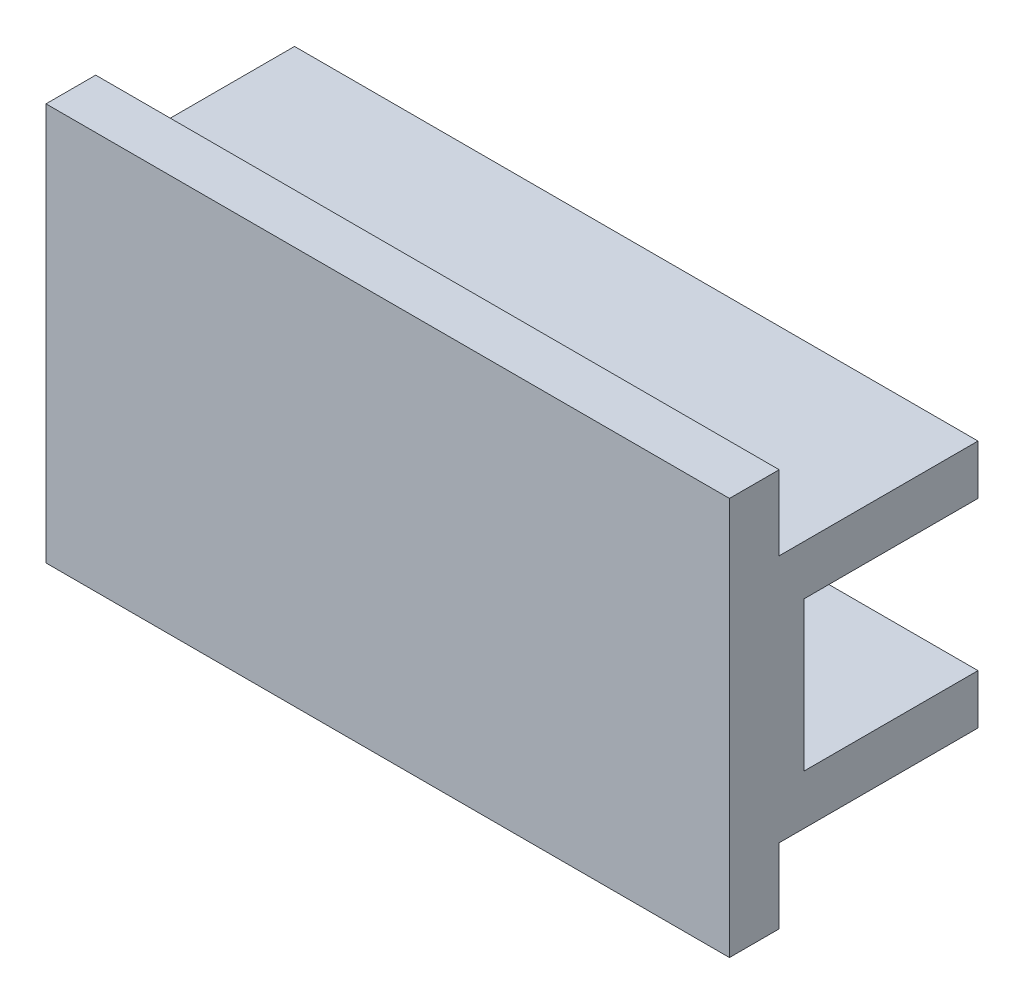
ISO-10303-21;
HEADER;
FILE_DESCRIPTION(('STEP AP214'),'2;1');
FILE_NAME('part.step','',(''),(''),'','','');
FILE_SCHEMA(('AUTOMOTIVE_DESIGN { 1 0 10303 214 1 1 1 1 }'));
ENDSEC;
DATA;
#1=APPLICATION_CONTEXT('core data for automotive mechanical design processes');
#2=APPLICATION_PROTOCOL_DEFINITION('international standard','automotive_design',2000,#1);
#3=PRODUCT_CONTEXT('',#1,'mechanical');
#4=PRODUCT('Part','Part','',(#3));
#5=PRODUCT_RELATED_PRODUCT_CATEGORY('part','',(#4));
#6=PRODUCT_DEFINITION_FORMATION('','',#4);
#7=PRODUCT_DEFINITION_CONTEXT('part definition',#1,'design');
#8=PRODUCT_DEFINITION('design','',#6,#7);
#9=PRODUCT_DEFINITION_SHAPE('','',#8);
#10=(LENGTH_UNIT() NAMED_UNIT(*) SI_UNIT(.MILLI.,.METRE.));
#11=(NAMED_UNIT(*) PLANE_ANGLE_UNIT() SI_UNIT($,.RADIAN.));
#12=(NAMED_UNIT(*) SI_UNIT($,.STERADIAN.) SOLID_ANGLE_UNIT());
#13=UNCERTAINTY_MEASURE_WITH_UNIT(LENGTH_MEASURE(1.E-05),#10,'distance_accuracy_value','');
#14=(GEOMETRIC_REPRESENTATION_CONTEXT(3) GLOBAL_UNCERTAINTY_ASSIGNED_CONTEXT((#13)) GLOBAL_UNIT_ASSIGNED_CONTEXT((#10,
#11,#12)) REPRESENTATION_CONTEXT('',''));
#15=CARTESIAN_POINT('',(0.,0.,0.));
#16=DIRECTION('',(0.,0.,1.));
#17=DIRECTION('',(1.,0.,0.));
#18=AXIS2_PLACEMENT_3D('',#15,#16,#17);
#19=CARTESIAN_POINT('',(13.75,8.,5.));
#20=DIRECTION('',(0.,0.,-1.));
#21=DIRECTION('',(-1.,0.,0.));
#22=AXIS2_PLACEMENT_3D('',#19,#20,#21);
#23=PLANE('',#22);
#24=DIRECTION('',(0.,-1.,0.));
#25=VECTOR('',#24,1.);
#26=CARTESIAN_POINT('',(-13.75,8.,5.));
#27=LINE('',#26,#25);
#28=CARTESIAN_POINT('',(-13.75,8.,5.));
#29=VERTEX_POINT('',#28);
#30=CARTESIAN_POINT('',(-13.75,-8.,5.));
#31=VERTEX_POINT('',#30);
#32=EDGE_CURVE('E152',#29,#31,#27,.T.);
#33=ORIENTED_EDGE('',*,*,#32,.T.);
#34=DIRECTION('',(-1.,0.,0.));
#35=VECTOR('',#34,1.);
#36=CARTESIAN_POINT('',(13.75,-8.,5.));
#37=LINE('',#36,#35);
#38=CARTESIAN_POINT('',(13.75,-8.,5.));
#39=VERTEX_POINT('',#38);
#40=EDGE_CURVE('E11',#39,#31,#37,.T.);
#41=ORIENTED_EDGE('',*,*,#40,.F.);
#42=DIRECTION('',(0.,-1.,0.));
#43=VECTOR('',#42,1.);
#44=CARTESIAN_POINT('',(13.75,8.,5.));
#45=LINE('',#44,#43);
#46=CARTESIAN_POINT('',(13.75,8.,5.));
#47=VERTEX_POINT('',#46);
#48=EDGE_CURVE('E174',#47,#39,#45,.T.);
#49=ORIENTED_EDGE('',*,*,#48,.F.);
#50=DIRECTION('',(-1.,0.,0.));
#51=VECTOR('',#50,1.);
#52=CARTESIAN_POINT('',(13.75,8.,5.));
#53=LINE('',#52,#51);
#54=EDGE_CURVE('E148',#47,#29,#53,.T.);
#55=ORIENTED_EDGE('',*,*,#54,.T.);
#56=EDGE_LOOP('',(#33,#41,#49,#55));
#57=FACE_BOUND('',#56,.T.);
#58=ADVANCED_FACE('F34',(#57),#23,.F.);
#59=CARTESIAN_POINT('',(13.75,-8.,5.));
#60=DIRECTION('',(0.,1.,0.));
#61=DIRECTION('',(0.,0.,1.));
#62=AXIS2_PLACEMENT_3D('',#59,#60,#61);
#63=PLANE('',#62);
#64=DIRECTION('',(0.,0.,-1.));
#65=VECTOR('',#64,1.);
#66=CARTESIAN_POINT('',(-13.75,-8.,5.));
#67=LINE('',#66,#65);
#68=CARTESIAN_POINT('',(-13.75,-8.,3.));
#69=VERTEX_POINT('',#68);
#70=EDGE_CURVE('E155',#31,#69,#67,.T.);
#71=ORIENTED_EDGE('',*,*,#70,.T.);
#72=DIRECTION('',(-1.,0.,0.));
#73=VECTOR('',#72,1.);
#74=CARTESIAN_POINT('',(13.75,-8.,3.));
#75=LINE('',#74,#73);
#76=CARTESIAN_POINT('',(13.75,-8.,3.));
#77=VERTEX_POINT('',#76);
#78=EDGE_CURVE('E42',#77,#69,#75,.T.);
#79=ORIENTED_EDGE('',*,*,#78,.F.);
#80=DIRECTION('',(0.,0.,-1.));
#81=VECTOR('',#80,1.);
#82=CARTESIAN_POINT('',(13.75,-8.,5.));
#83=LINE('',#82,#81);
#84=EDGE_CURVE('E100',#39,#77,#83,.T.);
#85=ORIENTED_EDGE('',*,*,#84,.F.);
#86=ORIENTED_EDGE('',*,*,#40,.T.);
#87=EDGE_LOOP('',(#71,#79,#85,#86));
#88=FACE_BOUND('',#87,.T.);
#89=ADVANCED_FACE('F253',(#88),#63,.F.);
#90=CARTESIAN_POINT('',(13.75,-5.,3.));
#91=DIRECTION('',(0.,0.,1.));
#92=DIRECTION('',(0.,-1.,0.));
#93=AXIS2_PLACEMENT_3D('',#90,#91,#92);
#94=PLANE('',#93);
#95=DIRECTION('',(0.,1.,0.));
#96=VECTOR('',#95,1.);
#97=CARTESIAN_POINT('',(-13.75,-5.,3.));
#98=LINE('',#97,#96);
#99=CARTESIAN_POINT('',(-13.75,-5.,3.));
#100=VERTEX_POINT('',#99);
#101=EDGE_CURVE('E158',#69,#100,#98,.T.);
#102=ORIENTED_EDGE('',*,*,#101,.T.);
#103=DIRECTION('',(-1.,0.,0.));
#104=VECTOR('',#103,1.);
#105=CARTESIAN_POINT('',(13.75,-5.,3.));
#106=LINE('',#105,#104);
#107=CARTESIAN_POINT('',(13.75,-5.,3.));
#108=VERTEX_POINT('',#107);
#109=EDGE_CURVE('E193',#108,#100,#106,.T.);
#110=ORIENTED_EDGE('',*,*,#109,.F.);
#111=DIRECTION('',(0.,1.,0.));
#112=VECTOR('',#111,1.);
#113=CARTESIAN_POINT('',(13.75,-5.,3.));
#114=LINE('',#113,#112);
#115=EDGE_CURVE('E201',#77,#108,#114,.T.);
#116=ORIENTED_EDGE('',*,*,#115,.F.);
#117=ORIENTED_EDGE('',*,*,#78,.T.);
#118=EDGE_LOOP('',(#102,#110,#116,#117));
#119=FACE_BOUND('',#118,.T.);
#120=ADVANCED_FACE('F199',(#119),#94,.F.);
#121=CARTESIAN_POINT('',(13.75,-5.,-5.));
#122=DIRECTION('',(0.,1.,0.));
#123=DIRECTION('',(0.,0.,1.));
#124=AXIS2_PLACEMENT_3D('',#121,#122,#123);
#125=PLANE('',#124);
#126=DIRECTION('',(0.,0.,-1.));
#127=VECTOR('',#126,1.);
#128=CARTESIAN_POINT('',(-13.75,-5.,-5.));
#129=LINE('',#128,#127);
#130=CARTESIAN_POINT('',(-13.75,-5.,-5.));
#131=VERTEX_POINT('',#130);
#132=EDGE_CURVE('E160',#100,#131,#129,.T.);
#133=ORIENTED_EDGE('',*,*,#132,.T.);
#134=DIRECTION('',(-1.,0.,0.));
#135=VECTOR('',#134,1.);
#136=CARTESIAN_POINT('',(13.75,-5.,-5.));
#137=LINE('',#136,#135);
#138=CARTESIAN_POINT('',(13.75,-5.,-5.));
#139=VERTEX_POINT('',#138);
#140=EDGE_CURVE('E190',#139,#131,#137,.T.);
#141=ORIENTED_EDGE('',*,*,#140,.F.);
#142=DIRECTION('',(0.,0.,-1.));
#143=VECTOR('',#142,1.);
#144=CARTESIAN_POINT('',(13.75,-5.,-5.));
#145=LINE('',#144,#143);
#146=EDGE_CURVE('E220',#108,#139,#145,.T.);
#147=ORIENTED_EDGE('',*,*,#146,.F.);
#148=ORIENTED_EDGE('',*,*,#109,.T.);
#149=EDGE_LOOP('',(#133,#141,#147,#148));
#150=FACE_BOUND('',#149,.T.);
#151=ADVANCED_FACE('F211',(#150),#125,.F.);
#152=CARTESIAN_POINT('',(13.75,-3.,-5.));
#153=DIRECTION('',(0.,0.,1.));
#154=DIRECTION('',(1.,0.,0.));
#155=AXIS2_PLACEMENT_3D('',#152,#153,#154);
#156=PLANE('',#155);
#157=DIRECTION('',(0.,1.,0.));
#158=VECTOR('',#157,1.);
#159=CARTESIAN_POINT('',(-13.75,-3.,-5.));
#160=LINE('',#159,#158);
#161=CARTESIAN_POINT('',(-13.75,-3.,-5.));
#162=VERTEX_POINT('',#161);
#163=EDGE_CURVE('E162',#131,#162,#160,.T.);
#164=ORIENTED_EDGE('',*,*,#163,.T.);
#165=DIRECTION('',(-1.,0.,0.));
#166=VECTOR('',#165,1.);
#167=CARTESIAN_POINT('',(13.75,-3.,-5.));
#168=LINE('',#167,#166);
#169=CARTESIAN_POINT('',(13.75,-3.,-5.));
#170=VERTEX_POINT('',#169);
#171=EDGE_CURVE('E187',#170,#162,#168,.T.);
#172=ORIENTED_EDGE('',*,*,#171,.F.);
#173=DIRECTION('',(0.,1.,0.));
#174=VECTOR('',#173,1.);
#175=CARTESIAN_POINT('',(13.75,-3.,-5.));
#176=LINE('',#175,#174);
#177=EDGE_CURVE('E217',#139,#170,#176,.T.);
#178=ORIENTED_EDGE('',*,*,#177,.F.);
#179=ORIENTED_EDGE('',*,*,#140,.T.);
#180=EDGE_LOOP('',(#164,#172,#178,#179));
#181=FACE_BOUND('',#180,.T.);
#182=ADVANCED_FACE('F215',(#181),#156,.F.);
#183=CARTESIAN_POINT('',(13.75,-3.,2.));
#184=DIRECTION('',(0.,-1.,0.));
#185=DIRECTION('',(0.,0.,-1.));
#186=AXIS2_PLACEMENT_3D('',#183,#184,#185);
#187=PLANE('',#186);
#188=DIRECTION('',(0.,0.,1.));
#189=VECTOR('',#188,1.);
#190=CARTESIAN_POINT('',(-13.75,-3.,2.));
#191=LINE('',#190,#189);
#192=CARTESIAN_POINT('',(-13.75,-3.,3.));
#193=VERTEX_POINT('',#192);
#194=EDGE_CURVE('E164',#162,#193,#191,.T.);
#195=ORIENTED_EDGE('',*,*,#194,.T.);
#196=DIRECTION('',(-1.,0.,0.));
#197=VECTOR('',#196,1.);
#198=CARTESIAN_POINT('',(7.75,-3.,3.));
#199=LINE('',#198,#197);
#200=CARTESIAN_POINT('',(7.75,-3.,3.));
#201=VERTEX_POINT('',#200);
#202=EDGE_CURVE('E365',#201,#193,#199,.T.);
#203=ORIENTED_EDGE('',*,*,#202,.F.);
#204=DIRECTION('',(0.,0.,1.));
#205=VECTOR('',#204,1.);
#206=CARTESIAN_POINT('',(7.75,-3.,3.));
#207=LINE('',#206,#205);
#208=CARTESIAN_POINT('',(7.75,-3.,2.));
#209=VERTEX_POINT('',#208);
#210=EDGE_CURVE('E366',#209,#201,#207,.T.);
#211=ORIENTED_EDGE('',*,*,#210,.F.);
#212=DIRECTION('',(-1.,0.,0.));
#213=VECTOR('',#212,1.);
#214=CARTESIAN_POINT('',(13.75,-3.,2.));
#215=LINE('',#214,#213);
#216=CARTESIAN_POINT('',(13.75,-3.,2.));
#217=VERTEX_POINT('',#216);
#218=EDGE_CURVE('E184',#217,#209,#215,.T.);
#219=ORIENTED_EDGE('',*,*,#218,.F.);
#220=DIRECTION('',(0.,0.,1.));
#221=VECTOR('',#220,1.);
#222=CARTESIAN_POINT('',(13.75,-3.,2.));
#223=LINE('',#222,#221);
#224=EDGE_CURVE('E219',#170,#217,#223,.T.);
#225=ORIENTED_EDGE('',*,*,#224,.F.);
#226=ORIENTED_EDGE('',*,*,#171,.T.);
#227=EDGE_LOOP('',(#195,#203,#211,#219,#225,#226));
#228=FACE_BOUND('',#227,.T.);
#229=ADVANCED_FACE('F266',(#228),#187,.F.);
#230=CARTESIAN_POINT('',(13.75,3.,2.));
#231=DIRECTION('',(0.,0.,1.));
#232=DIRECTION('',(0.,-1.,0.));
#233=AXIS2_PLACEMENT_3D('',#230,#231,#232);
#234=PLANE('',#233);
#235=ORIENTED_EDGE('',*,*,#218,.T.);
#236=CARTESIAN_POINT('',(7.75,0.,2.));
#237=DIRECTION('',(0.,0.,-1.));
#238=DIRECTION('',(0.,1.,0.));
#239=AXIS2_PLACEMENT_3D('',#236,#237,#238);
#240=CIRCLE('',#239,3.);
#241=CARTESIAN_POINT('',(7.75,3.,2.));
#242=VERTEX_POINT('',#241);
#243=EDGE_CURVE('E358',#242,#209,#240,.T.);
#244=ORIENTED_EDGE('',*,*,#243,.F.);
#245=DIRECTION('',(-1.,0.,0.));
#246=VECTOR('',#245,1.);
#247=CARTESIAN_POINT('',(13.75,3.,2.));
#248=LINE('',#247,#246);
#249=CARTESIAN_POINT('',(13.75,3.,2.));
#250=VERTEX_POINT('',#249);
#251=EDGE_CURVE('E181',#250,#242,#248,.T.);
#252=ORIENTED_EDGE('',*,*,#251,.F.);
#253=DIRECTION('',(0.,1.,0.));
#254=VECTOR('',#253,1.);
#255=CARTESIAN_POINT('',(13.75,3.,2.));
#256=LINE('',#255,#254);
#257=EDGE_CURVE('E222',#217,#250,#256,.T.);
#258=ORIENTED_EDGE('',*,*,#257,.F.);
#259=EDGE_LOOP('',(#235,#244,#252,#258));
#260=FACE_BOUND('',#259,.T.);
#261=ADVANCED_FACE('F269',(#260),#234,.F.);
#262=CARTESIAN_POINT('',(13.75,3.,-5.));
#263=DIRECTION('',(0.,1.,0.));
#264=DIRECTION('',(0.,0.,1.));
#265=AXIS2_PLACEMENT_3D('',#262,#263,#264);
#266=PLANE('',#265);
#267=DIRECTION('',(0.,0.,-1.));
#268=VECTOR('',#267,1.);
#269=CARTESIAN_POINT('',(-13.75,3.,-5.));
#270=LINE('',#269,#268);
#271=CARTESIAN_POINT('',(-13.75,3.,3.));
#272=VERTEX_POINT('',#271);
#273=CARTESIAN_POINT('',(-13.75,3.,-5.));
#274=VERTEX_POINT('',#273);
#275=EDGE_CURVE('E167',#272,#274,#270,.T.);
#276=ORIENTED_EDGE('',*,*,#275,.T.);
#277=DIRECTION('',(-1.,0.,0.));
#278=VECTOR('',#277,1.);
#279=CARTESIAN_POINT('',(13.75,3.,-5.));
#280=LINE('',#279,#278);
#281=CARTESIAN_POINT('',(13.75,3.,-5.));
#282=VERTEX_POINT('',#281);
#283=EDGE_CURVE('E178',#282,#274,#280,.T.);
#284=ORIENTED_EDGE('',*,*,#283,.F.);
#285=DIRECTION('',(0.,0.,-1.));
#286=VECTOR('',#285,1.);
#287=CARTESIAN_POINT('',(13.75,3.,-5.));
#288=LINE('',#287,#286);
#289=EDGE_CURVE('E228',#250,#282,#288,.T.);
#290=ORIENTED_EDGE('',*,*,#289,.F.);
#291=ORIENTED_EDGE('',*,*,#251,.T.);
#292=DIRECTION('',(0.,0.,-1.));
#293=VECTOR('',#292,1.);
#294=CARTESIAN_POINT('',(7.75,3.,2.));
#295=LINE('',#294,#293);
#296=CARTESIAN_POINT('',(7.75,3.,3.));
#297=VERTEX_POINT('',#296);
#298=EDGE_CURVE('E354',#297,#242,#295,.T.);
#299=ORIENTED_EDGE('',*,*,#298,.F.);
#300=DIRECTION('',(-1.,0.,0.));
#301=VECTOR('',#300,1.);
#302=CARTESIAN_POINT('',(7.75,3.,3.));
#303=LINE('',#302,#301);
#304=EDGE_CURVE('E156',#297,#272,#303,.T.);
#305=ORIENTED_EDGE('',*,*,#304,.T.);
#306=EDGE_LOOP('',(#276,#284,#290,#291,#299,#305));
#307=FACE_BOUND('',#306,.T.);
#308=ADVANCED_FACE('F234',(#307),#266,.F.);
#309=CARTESIAN_POINT('',(13.75,5.,-5.));
#310=DIRECTION('',(0.,0.,1.));
#311=DIRECTION('',(1.,0.,0.));
#312=AXIS2_PLACEMENT_3D('',#309,#310,#311);
#313=PLANE('',#312);
#314=DIRECTION('',(0.,1.,0.));
#315=VECTOR('',#314,1.);
#316=CARTESIAN_POINT('',(-13.75,5.,-5.));
#317=LINE('',#316,#315);
#318=CARTESIAN_POINT('',(-13.75,5.,-5.));
#319=VERTEX_POINT('',#318);
#320=EDGE_CURVE('E169',#274,#319,#317,.T.);
#321=ORIENTED_EDGE('',*,*,#320,.T.);
#322=DIRECTION('',(-1.,0.,0.));
#323=VECTOR('',#322,1.);
#324=CARTESIAN_POINT('',(13.75,5.,-5.));
#325=LINE('',#324,#323);
#326=CARTESIAN_POINT('',(13.75,5.,-5.));
#327=VERTEX_POINT('',#326);
#328=EDGE_CURVE('E143',#327,#319,#325,.T.);
#329=ORIENTED_EDGE('',*,*,#328,.F.);
#330=DIRECTION('',(0.,1.,0.));
#331=VECTOR('',#330,1.);
#332=CARTESIAN_POINT('',(13.75,5.,-5.));
#333=LINE('',#332,#331);
#334=EDGE_CURVE('E134',#282,#327,#333,.T.);
#335=ORIENTED_EDGE('',*,*,#334,.F.);
#336=ORIENTED_EDGE('',*,*,#283,.T.);
#337=EDGE_LOOP('',(#321,#329,#335,#336));
#338=FACE_BOUND('',#337,.T.);
#339=ADVANCED_FACE('F238',(#338),#313,.F.);
#340=CARTESIAN_POINT('',(13.75,5.,3.));
#341=DIRECTION('',(0.,-1.,0.));
#342=DIRECTION('',(0.,0.,-1.));
#343=AXIS2_PLACEMENT_3D('',#340,#341,#342);
#344=PLANE('',#343);
#345=DIRECTION('',(0.,0.,1.));
#346=VECTOR('',#345,1.);
#347=CARTESIAN_POINT('',(-13.75,5.,3.));
#348=LINE('',#347,#346);
#349=CARTESIAN_POINT('',(-13.75,5.,3.));
#350=VERTEX_POINT('',#349);
#351=EDGE_CURVE('E142',#319,#350,#348,.T.);
#352=ORIENTED_EDGE('',*,*,#351,.T.);
#353=DIRECTION('',(-1.,0.,0.));
#354=VECTOR('',#353,1.);
#355=CARTESIAN_POINT('',(13.75,5.,3.));
#356=LINE('',#355,#354);
#357=CARTESIAN_POINT('',(13.75,5.,3.));
#358=VERTEX_POINT('',#357);
#359=EDGE_CURVE('E139',#358,#350,#356,.T.);
#360=ORIENTED_EDGE('',*,*,#359,.F.);
#361=DIRECTION('',(0.,0.,1.));
#362=VECTOR('',#361,1.);
#363=CARTESIAN_POINT('',(13.75,5.,3.));
#364=LINE('',#363,#362);
#365=EDGE_CURVE('E128',#327,#358,#364,.T.);
#366=ORIENTED_EDGE('',*,*,#365,.F.);
#367=ORIENTED_EDGE('',*,*,#328,.T.);
#368=EDGE_LOOP('',(#352,#360,#366,#367));
#369=FACE_BOUND('',#368,.T.);
#370=ADVANCED_FACE('F140',(#369),#344,.F.);
#371=CARTESIAN_POINT('',(13.75,8.,3.));
#372=DIRECTION('',(0.,0.,1.));
#373=DIRECTION('',(0.,-1.,0.));
#374=AXIS2_PLACEMENT_3D('',#371,#372,#373);
#375=PLANE('',#374);
#376=DIRECTION('',(0.,1.,0.));
#377=VECTOR('',#376,1.);
#378=CARTESIAN_POINT('',(-13.75,8.,3.));
#379=LINE('',#378,#377);
#380=CARTESIAN_POINT('',(-13.75,8.,3.));
#381=VERTEX_POINT('',#380);
#382=EDGE_CURVE('E86',#350,#381,#379,.T.);
#383=ORIENTED_EDGE('',*,*,#382,.T.);
#384=DIRECTION('',(-1.,0.,0.));
#385=VECTOR('',#384,1.);
#386=CARTESIAN_POINT('',(13.75,8.,3.));
#387=LINE('',#386,#385);
#388=CARTESIAN_POINT('',(13.75,8.,3.));
#389=VERTEX_POINT('',#388);
#390=EDGE_CURVE('E144',#389,#381,#387,.T.);
#391=ORIENTED_EDGE('',*,*,#390,.F.);
#392=DIRECTION('',(0.,1.,0.));
#393=VECTOR('',#392,1.);
#394=CARTESIAN_POINT('',(13.75,8.,3.));
#395=LINE('',#394,#393);
#396=EDGE_CURVE('E132',#358,#389,#395,.T.);
#397=ORIENTED_EDGE('',*,*,#396,.F.);
#398=ORIENTED_EDGE('',*,*,#359,.T.);
#399=EDGE_LOOP('',(#383,#391,#397,#398));
#400=FACE_BOUND('',#399,.T.);
#401=ADVANCED_FACE('F146',(#400),#375,.F.);
#402=CARTESIAN_POINT('',(13.75,8.,5.));
#403=DIRECTION('',(0.,-1.,0.));
#404=DIRECTION('',(0.,0.,-1.));
#405=AXIS2_PLACEMENT_3D('',#402,#403,#404);
#406=PLANE('',#405);
#407=DIRECTION('',(0.,0.,1.));
#408=VECTOR('',#407,1.);
#409=CARTESIAN_POINT('',(-13.75,8.,5.));
#410=LINE('',#409,#408);
#411=EDGE_CURVE('E92',#381,#29,#410,.T.);
#412=ORIENTED_EDGE('',*,*,#411,.T.);
#413=ORIENTED_EDGE('',*,*,#54,.F.);
#414=DIRECTION('',(0.,0.,1.));
#415=VECTOR('',#414,1.);
#416=CARTESIAN_POINT('',(13.75,8.,5.));
#417=LINE('',#416,#415);
#418=EDGE_CURVE('E50',#389,#47,#417,.T.);
#419=ORIENTED_EDGE('',*,*,#418,.F.);
#420=ORIENTED_EDGE('',*,*,#390,.T.);
#421=EDGE_LOOP('',(#412,#413,#419,#420));
#422=FACE_BOUND('',#421,.T.);
#423=ADVANCED_FACE('F242',(#422),#406,.F.);
#424=CARTESIAN_POINT('',(13.75,-8.,5.));
#425=DIRECTION('',(1.,0.,0.));
#426=DIRECTION('',(0.,0.,-1.));
#427=AXIS2_PLACEMENT_3D('',#424,#425,#426);
#428=PLANE('',#427);
#429=ORIENTED_EDGE('',*,*,#48,.T.);
#430=ORIENTED_EDGE('',*,*,#84,.T.);
#431=ORIENTED_EDGE('',*,*,#115,.T.);
#432=ORIENTED_EDGE('',*,*,#146,.T.);
#433=ORIENTED_EDGE('',*,*,#177,.T.);
#434=ORIENTED_EDGE('',*,*,#224,.T.);
#435=ORIENTED_EDGE('',*,*,#257,.T.);
#436=ORIENTED_EDGE('',*,*,#289,.T.);
#437=ORIENTED_EDGE('',*,*,#334,.T.);
#438=ORIENTED_EDGE('',*,*,#365,.T.);
#439=ORIENTED_EDGE('',*,*,#396,.T.);
#440=ORIENTED_EDGE('',*,*,#418,.T.);
#441=EDGE_LOOP('',(#429,#430,#431,#432,#433,#434,#435,#436,#437,#438,#439,#440));
#442=FACE_BOUND('',#441,.T.);
#443=ADVANCED_FACE('F130',(#442),#428,.T.);
#444=CARTESIAN_POINT('',(-13.75,-8.,5.));
#445=DIRECTION('',(1.,0.,0.));
#446=DIRECTION('',(0.,0.,-1.));
#447=AXIS2_PLACEMENT_3D('',#444,#445,#446);
#448=PLANE('',#447);
#449=ORIENTED_EDGE('',*,*,#275,.F.);
#450=DIRECTION('',(0.,1.,0.));
#451=VECTOR('',#450,1.);
#452=CARTESIAN_POINT('',(-13.75,3.,3.));
#453=LINE('',#452,#451);
#454=EDGE_CURVE('E370',#193,#272,#453,.T.);
#455=ORIENTED_EDGE('',*,*,#454,.F.);
#456=ORIENTED_EDGE('',*,*,#194,.F.);
#457=ORIENTED_EDGE('',*,*,#163,.F.);
#458=ORIENTED_EDGE('',*,*,#132,.F.);
#459=ORIENTED_EDGE('',*,*,#101,.F.);
#460=ORIENTED_EDGE('',*,*,#70,.F.);
#461=ORIENTED_EDGE('',*,*,#32,.F.);
#462=ORIENTED_EDGE('',*,*,#411,.F.);
#463=ORIENTED_EDGE('',*,*,#382,.F.);
#464=ORIENTED_EDGE('',*,*,#351,.F.);
#465=ORIENTED_EDGE('',*,*,#320,.F.);
#466=EDGE_LOOP('',(#449,#455,#456,#457,#458,#459,#460,#461,#462,#463,#464,#465));
#467=FACE_BOUND('',#466,.T.);
#468=ADVANCED_FACE('F205',(#467),#448,.F.);
#469=CARTESIAN_POINT('',(7.75,3.,3.));
#470=DIRECTION('',(0.,0.,1.));
#471=DIRECTION('',(0.,-1.,0.));
#472=AXIS2_PLACEMENT_3D('',#469,#470,#471);
#473=PLANE('',#472);
#474=ORIENTED_EDGE('',*,*,#454,.T.);
#475=ORIENTED_EDGE('',*,*,#304,.F.);
#476=CARTESIAN_POINT('',(7.75,0.,3.));
#477=DIRECTION('',(0.,0.,1.));
#478=DIRECTION('',(0.,-1.,0.));
#479=AXIS2_PLACEMENT_3D('',#476,#477,#478);
#480=CIRCLE('',#479,3.);
#481=EDGE_CURVE('E361',#297,#201,#480,.F.);
#482=ORIENTED_EDGE('',*,*,#481,.T.);
#483=ORIENTED_EDGE('',*,*,#202,.T.);
#484=EDGE_LOOP('',(#474,#475,#482,#483));
#485=FACE_BOUND('',#484,.T.);
#486=ADVANCED_FACE('F306',(#485),#473,.F.);
#487=CARTESIAN_POINT('',(7.75,0.,9.70820393249937));
#488=DIRECTION('',(0.,0.,-1.));
#489=DIRECTION('',(0.,1.,0.));
#490=AXIS2_PLACEMENT_3D('',#487,#488,#489);
#491=CYLINDRICAL_SURFACE('',#490,3.);
#492=ORIENTED_EDGE('',*,*,#298,.T.);
#493=ORIENTED_EDGE('',*,*,#243,.T.);
#494=ORIENTED_EDGE('',*,*,#210,.T.);
#495=ORIENTED_EDGE('',*,*,#481,.F.);
#496=EDGE_LOOP('',(#492,#493,#494,#495));
#497=FACE_BOUND('',#496,.T.);
#498=ADVANCED_FACE('F335',(#497),#491,.F.);
#499=CLOSED_SHELL('',(#58,#89,#120,#151,#182,#229,#261,#308,#339,#370,#401,#423,#443,#468,#486,#498));
#500=MANIFOLD_SOLID_BREP('B2',#499);
#501=ADVANCED_BREP_SHAPE_REPRESENTATION('',(#18,#500),#14);
#502=SHAPE_DEFINITION_REPRESENTATION(#9,#501);
ENDSEC;
END-ISO-10303-21;
